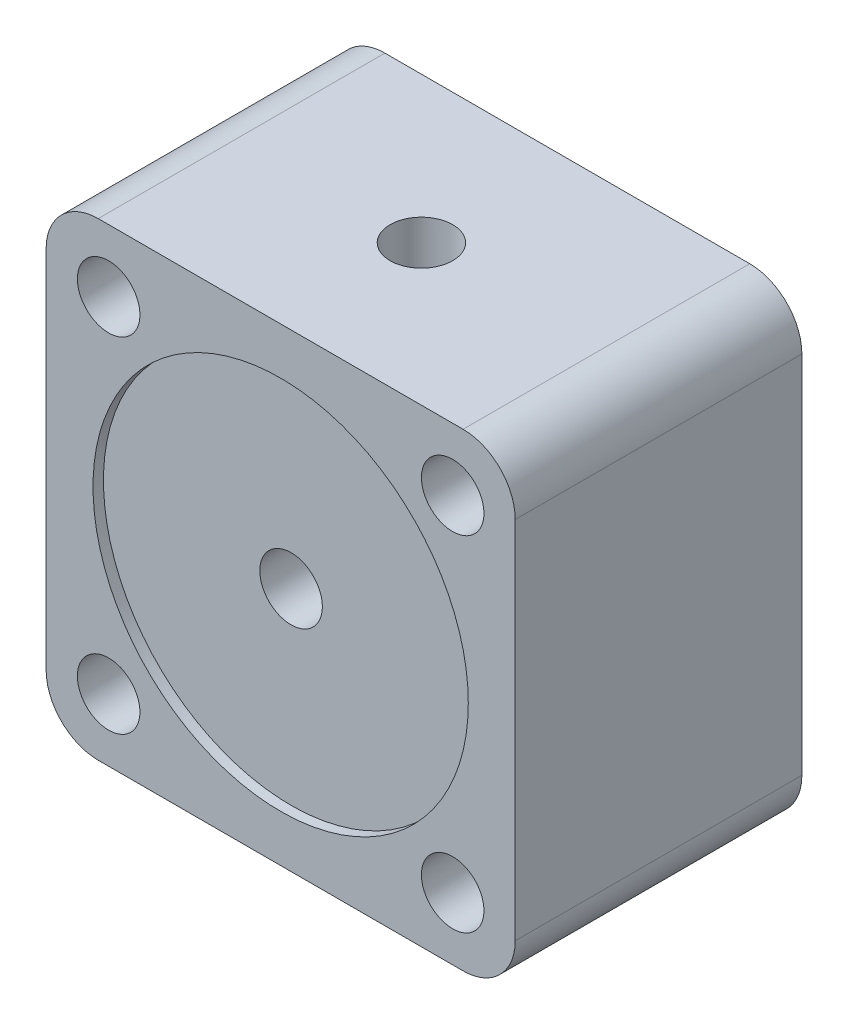
ISO-10303-21;
HEADER;
FILE_DESCRIPTION(('STEP AP214'),'2;1');
FILE_NAME('part.step','',(''),(''),'','','');
FILE_SCHEMA(('AUTOMOTIVE_DESIGN { 1 0 10303 214 1 1 1 1 }'));
ENDSEC;
DATA;
#1=APPLICATION_CONTEXT('core data for automotive mechanical design processes');
#2=APPLICATION_PROTOCOL_DEFINITION('international standard','automotive_design',2000,#1);
#3=PRODUCT_CONTEXT('',#1,'mechanical');
#4=PRODUCT('Part','Part','',(#3));
#5=PRODUCT_RELATED_PRODUCT_CATEGORY('part','',(#4));
#6=PRODUCT_DEFINITION_FORMATION('','',#4);
#7=PRODUCT_DEFINITION_CONTEXT('part definition',#1,'design');
#8=PRODUCT_DEFINITION('design','',#6,#7);
#9=PRODUCT_DEFINITION_SHAPE('','',#8);
#10=(LENGTH_UNIT() NAMED_UNIT(*) SI_UNIT(.MILLI.,.METRE.));
#11=(NAMED_UNIT(*) PLANE_ANGLE_UNIT() SI_UNIT($,.RADIAN.));
#12=(NAMED_UNIT(*) SI_UNIT($,.STERADIAN.) SOLID_ANGLE_UNIT());
#13=UNCERTAINTY_MEASURE_WITH_UNIT(LENGTH_MEASURE(1.E-05),#10,'distance_accuracy_value','');
#14=(GEOMETRIC_REPRESENTATION_CONTEXT(3) GLOBAL_UNCERTAINTY_ASSIGNED_CONTEXT((#13)) GLOBAL_UNIT_ASSIGNED_CONTEXT((#10,
#11,#12)) REPRESENTATION_CONTEXT('',''));
#15=CARTESIAN_POINT('',(0.,0.,0.));
#16=DIRECTION('',(0.,0.,1.));
#17=DIRECTION('',(1.,0.,0.));
#18=AXIS2_PLACEMENT_3D('',#15,#16,#17);
#19=CARTESIAN_POINT('',(-22.5,25.,14.));
#20=DIRECTION('',(0.,1.,0.));
#21=DIRECTION('',(-1.,0.,0.));
#22=AXIS2_PLACEMENT_3D('',#19,#20,#21);
#23=PLANE('',#22);
#24=DIRECTION('',(0.,0.,1.));
#25=VECTOR('',#24,1.);
#26=CARTESIAN_POINT('',(-24.1583123951777,25.,10.5));
#27=LINE('',#26,#25);
#28=CARTESIAN_POINT('',(-24.1583123951777,25.,11.5));
#29=VERTEX_POINT('',#28);
#30=CARTESIAN_POINT('',(-24.1583123951777,25.,16.5));
#31=VERTEX_POINT('',#30);
#32=EDGE_CURVE('E11',#29,#31,#27,.T.);
#33=ORIENTED_EDGE('',*,*,#32,.F.);
#34=CARTESIAN_POINT('',(-22.5,25.,14.));
#35=DIRECTION('',(0.,1.,0.));
#36=DIRECTION('',(-1.,0.,0.));
#37=AXIS2_PLACEMENT_3D('',#34,#35,#36);
#38=CIRCLE('',#37,3.);
#39=EDGE_CURVE('E189',#29,#31,#38,.T.);
#40=ORIENTED_EDGE('',*,*,#39,.T.);
#41=EDGE_LOOP('',(#33,#40));
#42=FACE_BOUND('',#41,.T.);
#43=ADVANCED_FACE('F32',(#42),#23,.T.);
#44=CARTESIAN_POINT('',(-40.,40.,27.5));
#45=DIRECTION('',(0.,0.,1.));
#46=DIRECTION('',(1.,0.,0.));
#47=AXIS2_PLACEMENT_3D('',#44,#45,#46);
#48=PLANE('',#47);
#49=CARTESIAN_POINT('',(-22.5,22.5,27.5));
#50=DIRECTION('',(0.,0.,1.));
#51=DIRECTION('',(1.,0.,0.));
#52=AXIS2_PLACEMENT_3D('',#49,#50,#51);
#53=CIRCLE('',#52,18.);
#54=CARTESIAN_POINT('',(-4.50000000000001,22.5,27.5));
#55=VERTEX_POINT('',#54);
#56=EDGE_CURVE('E193',#55,#55,#53,.T.);
#57=ORIENTED_EDGE('',*,*,#56,.F.);
#58=EDGE_LOOP('',(#57));
#59=FACE_BOUND('',#58,.T.);
#60=CARTESIAN_POINT('',(-39.,5.99999999999998,27.5));
#61=DIRECTION('',(0.,0.,1.));
#62=DIRECTION('',(-1.,0.,0.));
#63=AXIS2_PLACEMENT_3D('',#60,#61,#62);
#64=CIRCLE('',#63,3.);
#65=CARTESIAN_POINT('',(-42.,5.99999999999998,27.5));
#66=VERTEX_POINT('',#65);
#67=EDGE_CURVE('E211',#66,#66,#64,.T.);
#68=ORIENTED_EDGE('',*,*,#67,.F.);
#69=EDGE_LOOP('',(#68));
#70=FACE_BOUND('',#69,.T.);
#71=CARTESIAN_POINT('',(-6.00000000000001,39.,27.5));
#72=DIRECTION('',(0.,0.,1.));
#73=DIRECTION('',(1.,0.,0.));
#74=AXIS2_PLACEMENT_3D('',#71,#72,#73);
#75=CIRCLE('',#74,3.);
#76=CARTESIAN_POINT('',(-3.,39.,27.5));
#77=VERTEX_POINT('',#76);
#78=EDGE_CURVE('E145',#77,#77,#75,.T.);
#79=ORIENTED_EDGE('',*,*,#78,.F.);
#80=EDGE_LOOP('',(#79));
#81=FACE_BOUND('',#80,.T.);
#82=CARTESIAN_POINT('',(-40.,40.,27.5));
#83=DIRECTION('',(0.,0.,1.));
#84=DIRECTION('',(1.,0.,0.));
#85=AXIS2_PLACEMENT_3D('',#82,#83,#84);
#86=CIRCLE('',#85,5.);
#87=CARTESIAN_POINT('',(-40.,45.,27.5));
#88=VERTEX_POINT('',#87);
#89=CARTESIAN_POINT('',(-45.,40.,27.5));
#90=VERTEX_POINT('',#89);
#91=EDGE_CURVE('E157',#88,#90,#86,.T.);
#92=ORIENTED_EDGE('',*,*,#91,.T.);
#93=DIRECTION('',(0.,-1.,0.));
#94=VECTOR('',#93,1.);
#95=CARTESIAN_POINT('',(-45.,40.,27.5));
#96=LINE('',#95,#94);
#97=CARTESIAN_POINT('',(-45.,5.00000000000003,27.5));
#98=VERTEX_POINT('',#97);
#99=EDGE_CURVE('E97',#90,#98,#96,.T.);
#100=ORIENTED_EDGE('',*,*,#99,.T.);
#101=CARTESIAN_POINT('',(-40.,4.99999999999999,27.5));
#102=DIRECTION('',(0.,0.,1.));
#103=DIRECTION('',(1.,0.,0.));
#104=AXIS2_PLACEMENT_3D('',#101,#102,#103);
#105=CIRCLE('',#104,5.);
#106=CARTESIAN_POINT('',(-40.,0.,27.5));
#107=VERTEX_POINT('',#106);
#108=EDGE_CURVE('E229',#98,#107,#105,.T.);
#109=ORIENTED_EDGE('',*,*,#108,.T.);
#110=DIRECTION('',(1.,0.,0.));
#111=VECTOR('',#110,1.);
#112=CARTESIAN_POINT('',(-40.,0.,27.5));
#113=LINE('',#112,#111);
#114=CARTESIAN_POINT('',(-5.00000000000004,0.,27.5));
#115=VERTEX_POINT('',#114);
#116=EDGE_CURVE('E231',#107,#115,#113,.T.);
#117=ORIENTED_EDGE('',*,*,#116,.T.);
#118=CARTESIAN_POINT('',(-5.,5.,27.5));
#119=DIRECTION('',(0.,0.,1.));
#120=DIRECTION('',(1.,0.,0.));
#121=AXIS2_PLACEMENT_3D('',#118,#119,#120);
#122=CIRCLE('',#121,5.);
#123=CARTESIAN_POINT('',(0.,5.00000000000004,27.5));
#124=VERTEX_POINT('',#123);
#125=EDGE_CURVE('E120',#115,#124,#122,.T.);
#126=ORIENTED_EDGE('',*,*,#125,.T.);
#127=DIRECTION('',(0.,1.,0.));
#128=VECTOR('',#127,1.);
#129=CARTESIAN_POINT('',(0.,40.,27.5));
#130=LINE('',#129,#128);
#131=CARTESIAN_POINT('',(0.,40.,27.5));
#132=VERTEX_POINT('',#131);
#133=EDGE_CURVE('E112',#124,#132,#130,.T.);
#134=ORIENTED_EDGE('',*,*,#133,.T.);
#135=CARTESIAN_POINT('',(-5.,40.,27.5));
#136=DIRECTION('',(0.,0.,1.));
#137=DIRECTION('',(1.,0.,0.));
#138=AXIS2_PLACEMENT_3D('',#135,#136,#137);
#139=CIRCLE('',#138,5.);
#140=CARTESIAN_POINT('',(-5.00000000000004,45.,27.5));
#141=VERTEX_POINT('',#140);
#142=EDGE_CURVE('E117',#132,#141,#139,.T.);
#143=ORIENTED_EDGE('',*,*,#142,.T.);
#144=DIRECTION('',(-1.,0.,0.));
#145=VECTOR('',#144,1.);
#146=CARTESIAN_POINT('',(-5.00000000000004,45.,27.5));
#147=LINE('',#146,#145);
#148=EDGE_CURVE('E55',#141,#88,#147,.T.);
#149=ORIENTED_EDGE('',*,*,#148,.T.);
#150=EDGE_LOOP('',(#92,#100,#109,#117,#126,#134,#143,#149));
#151=FACE_BOUND('',#150,.T.);
#152=CARTESIAN_POINT('',(-6.00000000000001,5.99999999999998,27.5));
#153=DIRECTION('',(0.,0.,1.));
#154=DIRECTION('',(1.,0.,0.));
#155=AXIS2_PLACEMENT_3D('',#152,#153,#154);
#156=CIRCLE('',#155,3.);
#157=CARTESIAN_POINT('',(-3.00000000000001,5.99999999999998,27.5));
#158=VERTEX_POINT('',#157);
#159=EDGE_CURVE('E217',#158,#158,#156,.T.);
#160=ORIENTED_EDGE('',*,*,#159,.F.);
#161=EDGE_LOOP('',(#160));
#162=FACE_BOUND('',#161,.T.);
#163=CARTESIAN_POINT('',(-39.,39.,27.5));
#164=DIRECTION('',(0.,0.,1.));
#165=DIRECTION('',(-1.,0.,0.));
#166=AXIS2_PLACEMENT_3D('',#163,#164,#165);
#167=CIRCLE('',#166,3.);
#168=CARTESIAN_POINT('',(-42.,39.,27.5));
#169=VERTEX_POINT('',#168);
#170=EDGE_CURVE('E205',#169,#169,#167,.T.);
#171=ORIENTED_EDGE('',*,*,#170,.F.);
#172=EDGE_LOOP('',(#171));
#173=FACE_BOUND('',#172,.T.);
#174=ADVANCED_FACE('F114',(#59,#70,#81,#151,#162,#173),#48,.T.);
#175=CARTESIAN_POINT('',(-40.,40.,0.));
#176=DIRECTION('',(0.,0.,1.));
#177=DIRECTION('',(1.,0.,0.));
#178=AXIS2_PLACEMENT_3D('',#175,#176,#177);
#179=PLANE('',#178);
#180=CARTESIAN_POINT('',(-40.,40.,0.));
#181=DIRECTION('',(0.,0.,1.));
#182=DIRECTION('',(1.,0.,0.));
#183=AXIS2_PLACEMENT_3D('',#180,#181,#182);
#184=CIRCLE('',#183,5.);
#185=CARTESIAN_POINT('',(-40.,45.,0.));
#186=VERTEX_POINT('',#185);
#187=CARTESIAN_POINT('',(-45.,40.,0.));
#188=VERTEX_POINT('',#187);
#189=EDGE_CURVE('E141',#186,#188,#184,.T.);
#190=ORIENTED_EDGE('',*,*,#189,.F.);
#191=DIRECTION('',(-1.,0.,0.));
#192=VECTOR('',#191,1.);
#193=CARTESIAN_POINT('',(-5.00000000000004,45.,0.));
#194=LINE('',#193,#192);
#195=CARTESIAN_POINT('',(-5.00000000000004,45.,0.));
#196=VERTEX_POINT('',#195);
#197=EDGE_CURVE('E88',#196,#186,#194,.T.);
#198=ORIENTED_EDGE('',*,*,#197,.F.);
#199=CARTESIAN_POINT('',(-5.,40.,0.));
#200=DIRECTION('',(0.,0.,1.));
#201=DIRECTION('',(1.,0.,0.));
#202=AXIS2_PLACEMENT_3D('',#199,#200,#201);
#203=CIRCLE('',#202,5.);
#204=CARTESIAN_POINT('',(0.,40.,0.));
#205=VERTEX_POINT('',#204);
#206=EDGE_CURVE('E154',#205,#196,#203,.T.);
#207=ORIENTED_EDGE('',*,*,#206,.F.);
#208=DIRECTION('',(0.,1.,0.));
#209=VECTOR('',#208,1.);
#210=CARTESIAN_POINT('',(0.,40.,0.));
#211=LINE('',#210,#209);
#212=CARTESIAN_POINT('',(0.,5.00000000000004,0.));
#213=VERTEX_POINT('',#212);
#214=EDGE_CURVE('E129',#213,#205,#211,.T.);
#215=ORIENTED_EDGE('',*,*,#214,.F.);
#216=CARTESIAN_POINT('',(-5.,5.,0.));
#217=DIRECTION('',(0.,0.,1.));
#218=DIRECTION('',(1.,0.,0.));
#219=AXIS2_PLACEMENT_3D('',#216,#217,#218);
#220=CIRCLE('',#219,5.);
#221=CARTESIAN_POINT('',(-5.00000000000004,0.,0.));
#222=VERTEX_POINT('',#221);
#223=EDGE_CURVE('E151',#222,#213,#220,.T.);
#224=ORIENTED_EDGE('',*,*,#223,.F.);
#225=DIRECTION('',(1.,0.,0.));
#226=VECTOR('',#225,1.);
#227=CARTESIAN_POINT('',(-40.,0.,0.));
#228=LINE('',#227,#226);
#229=CARTESIAN_POINT('',(-40.,0.,0.));
#230=VERTEX_POINT('',#229);
#231=EDGE_CURVE('E149',#230,#222,#228,.T.);
#232=ORIENTED_EDGE('',*,*,#231,.F.);
#233=CARTESIAN_POINT('',(-40.,4.99999999999999,0.));
#234=DIRECTION('',(0.,0.,1.));
#235=DIRECTION('',(1.,0.,0.));
#236=AXIS2_PLACEMENT_3D('',#233,#234,#235);
#237=CIRCLE('',#236,5.);
#238=CARTESIAN_POINT('',(-45.,5.00000000000003,0.));
#239=VERTEX_POINT('',#238);
#240=EDGE_CURVE('E147',#239,#230,#237,.T.);
#241=ORIENTED_EDGE('',*,*,#240,.F.);
#242=DIRECTION('',(0.,-1.,0.));
#243=VECTOR('',#242,1.);
#244=CARTESIAN_POINT('',(-45.,40.,0.));
#245=LINE('',#244,#243);
#246=EDGE_CURVE('E144',#188,#239,#245,.T.);
#247=ORIENTED_EDGE('',*,*,#246,.F.);
#248=EDGE_LOOP('',(#190,#198,#207,#215,#224,#232,#241,#247));
#249=FACE_BOUND('',#248,.T.);
#250=CARTESIAN_POINT('',(-6.00000000000001,39.,0.));
#251=DIRECTION('',(0.,0.,1.));
#252=DIRECTION('',(1.,0.,0.));
#253=AXIS2_PLACEMENT_3D('',#250,#251,#252);
#254=CIRCLE('',#253,3.);
#255=CARTESIAN_POINT('',(-3.,39.,0.));
#256=VERTEX_POINT('',#255);
#257=EDGE_CURVE('E220',#256,#256,#254,.T.);
#258=ORIENTED_EDGE('',*,*,#257,.T.);
#259=EDGE_LOOP('',(#258));
#260=FACE_BOUND('',#259,.T.);
#261=CARTESIAN_POINT('',(-6.00000000000001,5.99999999999998,0.));
#262=DIRECTION('',(0.,0.,1.));
#263=DIRECTION('',(1.,0.,0.));
#264=AXIS2_PLACEMENT_3D('',#261,#262,#263);
#265=CIRCLE('',#264,3.);
#266=CARTESIAN_POINT('',(-3.00000000000001,5.99999999999998,0.));
#267=VERTEX_POINT('',#266);
#268=EDGE_CURVE('E214',#267,#267,#265,.T.);
#269=ORIENTED_EDGE('',*,*,#268,.T.);
#270=EDGE_LOOP('',(#269));
#271=FACE_BOUND('',#270,.T.);
#272=CARTESIAN_POINT('',(-39.,5.99999999999998,0.));
#273=DIRECTION('',(0.,0.,1.));
#274=DIRECTION('',(-1.,0.,0.));
#275=AXIS2_PLACEMENT_3D('',#272,#273,#274);
#276=CIRCLE('',#275,3.);
#277=CARTESIAN_POINT('',(-42.,5.99999999999998,0.));
#278=VERTEX_POINT('',#277);
#279=EDGE_CURVE('E208',#278,#278,#276,.T.);
#280=ORIENTED_EDGE('',*,*,#279,.T.);
#281=EDGE_LOOP('',(#280));
#282=FACE_BOUND('',#281,.T.);
#283=CARTESIAN_POINT('',(-39.,39.,0.));
#284=DIRECTION('',(0.,0.,1.));
#285=DIRECTION('',(-1.,0.,0.));
#286=AXIS2_PLACEMENT_3D('',#283,#284,#285);
#287=CIRCLE('',#286,3.);
#288=CARTESIAN_POINT('',(-42.,39.,0.));
#289=VERTEX_POINT('',#288);
#290=EDGE_CURVE('E203',#289,#289,#287,.T.);
#291=ORIENTED_EDGE('',*,*,#290,.T.);
#292=EDGE_LOOP('',(#291));
#293=FACE_BOUND('',#292,.T.);
#294=ADVANCED_FACE('F244',(#249,#260,#271,#282,#293),#179,.F.);
#295=CARTESIAN_POINT('',(-40.,40.,27.5));
#296=DIRECTION('',(0.,0.,-1.));
#297=DIRECTION('',(-1.,0.,0.));
#298=AXIS2_PLACEMENT_3D('',#295,#296,#297);
#299=CYLINDRICAL_SURFACE('',#298,5.);
#300=ORIENTED_EDGE('',*,*,#189,.T.);
#301=DIRECTION('',(0.,0.,-1.));
#302=VECTOR('',#301,1.);
#303=CARTESIAN_POINT('',(-45.,40.,27.5));
#304=LINE('',#303,#302);
#305=EDGE_CURVE('E170',#90,#188,#304,.T.);
#306=ORIENTED_EDGE('',*,*,#305,.F.);
#307=ORIENTED_EDGE('',*,*,#91,.F.);
#308=DIRECTION('',(0.,0.,-1.));
#309=VECTOR('',#308,1.);
#310=CARTESIAN_POINT('',(-40.,45.,27.5));
#311=LINE('',#310,#309);
#312=EDGE_CURVE('E137',#88,#186,#311,.T.);
#313=ORIENTED_EDGE('',*,*,#312,.T.);
#314=EDGE_LOOP('',(#300,#306,#307,#313));
#315=FACE_BOUND('',#314,.T.);
#316=ADVANCED_FACE('F34',(#315),#299,.T.);
#317=CARTESIAN_POINT('',(-45.,40.,27.5));
#318=DIRECTION('',(1.,0.,0.));
#319=DIRECTION('',(0.,1.,0.));
#320=AXIS2_PLACEMENT_3D('',#317,#318,#319);
#321=PLANE('',#320);
#322=ORIENTED_EDGE('',*,*,#246,.T.);
#323=DIRECTION('',(0.,0.,-1.));
#324=VECTOR('',#323,1.);
#325=CARTESIAN_POINT('',(-45.,5.00000000000003,27.5));
#326=LINE('',#325,#324);
#327=EDGE_CURVE('E167',#98,#239,#326,.T.);
#328=ORIENTED_EDGE('',*,*,#327,.F.);
#329=ORIENTED_EDGE('',*,*,#99,.F.);
#330=ORIENTED_EDGE('',*,*,#305,.T.);
#331=EDGE_LOOP('',(#322,#328,#329,#330));
#332=FACE_BOUND('',#331,.T.);
#333=ADVANCED_FACE('F250',(#332),#321,.F.);
#334=CARTESIAN_POINT('',(-40.,4.99999999999999,27.5));
#335=DIRECTION('',(0.,0.,-1.));
#336=DIRECTION('',(-1.,0.,0.));
#337=AXIS2_PLACEMENT_3D('',#334,#335,#336);
#338=CYLINDRICAL_SURFACE('',#337,5.);
#339=ORIENTED_EDGE('',*,*,#240,.T.);
#340=DIRECTION('',(0.,0.,-1.));
#341=VECTOR('',#340,1.);
#342=CARTESIAN_POINT('',(-40.,0.,27.5));
#343=LINE('',#342,#341);
#344=EDGE_CURVE('E164',#107,#230,#343,.T.);
#345=ORIENTED_EDGE('',*,*,#344,.F.);
#346=ORIENTED_EDGE('',*,*,#108,.F.);
#347=ORIENTED_EDGE('',*,*,#327,.T.);
#348=EDGE_LOOP('',(#339,#345,#346,#347));
#349=FACE_BOUND('',#348,.T.);
#350=ADVANCED_FACE('F253',(#349),#338,.T.);
#351=CARTESIAN_POINT('',(-40.,0.,27.5));
#352=DIRECTION('',(0.,1.,0.));
#353=DIRECTION('',(-1.,0.,0.));
#354=AXIS2_PLACEMENT_3D('',#351,#352,#353);
#355=PLANE('',#354);
#356=ORIENTED_EDGE('',*,*,#231,.T.);
#357=DIRECTION('',(0.,0.,-1.));
#358=VECTOR('',#357,1.);
#359=CARTESIAN_POINT('',(-5.00000000000004,0.,27.5));
#360=LINE('',#359,#358);
#361=EDGE_CURVE('E161',#115,#222,#360,.T.);
#362=ORIENTED_EDGE('',*,*,#361,.F.);
#363=ORIENTED_EDGE('',*,*,#116,.F.);
#364=ORIENTED_EDGE('',*,*,#344,.T.);
#365=EDGE_LOOP('',(#356,#362,#363,#364));
#366=FACE_BOUND('',#365,.T.);
#367=ADVANCED_FACE('F237',(#366),#355,.F.);
#368=CARTESIAN_POINT('',(-5.,5.,27.5));
#369=DIRECTION('',(0.,0.,-1.));
#370=DIRECTION('',(-1.,0.,0.));
#371=AXIS2_PLACEMENT_3D('',#368,#369,#370);
#372=CYLINDRICAL_SURFACE('',#371,5.);
#373=ORIENTED_EDGE('',*,*,#223,.T.);
#374=DIRECTION('',(0.,0.,-1.));
#375=VECTOR('',#374,1.);
#376=CARTESIAN_POINT('',(0.,5.00000000000004,27.5));
#377=LINE('',#376,#375);
#378=EDGE_CURVE('E132',#124,#213,#377,.T.);
#379=ORIENTED_EDGE('',*,*,#378,.F.);
#380=ORIENTED_EDGE('',*,*,#125,.F.);
#381=ORIENTED_EDGE('',*,*,#361,.T.);
#382=EDGE_LOOP('',(#373,#379,#380,#381));
#383=FACE_BOUND('',#382,.T.);
#384=ADVANCED_FACE('F241',(#383),#372,.T.);
#385=CARTESIAN_POINT('',(0.,40.,27.5));
#386=DIRECTION('',(-1.,0.,0.));
#387=DIRECTION('',(0.,0.,1.));
#388=AXIS2_PLACEMENT_3D('',#385,#386,#387);
#389=PLANE('',#388);
#390=ORIENTED_EDGE('',*,*,#214,.T.);
#391=DIRECTION('',(0.,0.,-1.));
#392=VECTOR('',#391,1.);
#393=CARTESIAN_POINT('',(0.,40.,27.5));
#394=LINE('',#393,#392);
#395=EDGE_CURVE('E126',#132,#205,#394,.T.);
#396=ORIENTED_EDGE('',*,*,#395,.F.);
#397=ORIENTED_EDGE('',*,*,#133,.F.);
#398=ORIENTED_EDGE('',*,*,#378,.T.);
#399=EDGE_LOOP('',(#390,#396,#397,#398));
#400=FACE_BOUND('',#399,.T.);
#401=ADVANCED_FACE('F127',(#400),#389,.F.);
#402=CARTESIAN_POINT('',(-5.,40.,27.5));
#403=DIRECTION('',(0.,0.,-1.));
#404=DIRECTION('',(-1.,0.,0.));
#405=AXIS2_PLACEMENT_3D('',#402,#403,#404);
#406=CYLINDRICAL_SURFACE('',#405,5.);
#407=ORIENTED_EDGE('',*,*,#206,.T.);
#408=DIRECTION('',(0.,0.,-1.));
#409=VECTOR('',#408,1.);
#410=CARTESIAN_POINT('',(-5.00000000000004,45.,27.5));
#411=LINE('',#410,#409);
#412=EDGE_CURVE('E133',#141,#196,#411,.T.);
#413=ORIENTED_EDGE('',*,*,#412,.F.);
#414=ORIENTED_EDGE('',*,*,#142,.F.);
#415=ORIENTED_EDGE('',*,*,#395,.T.);
#416=EDGE_LOOP('',(#407,#413,#414,#415));
#417=FACE_BOUND('',#416,.T.);
#418=ADVANCED_FACE('F135',(#417),#406,.T.);
#419=CARTESIAN_POINT('',(-5.00000000000004,45.,27.5));
#420=DIRECTION('',(0.,-1.,0.));
#421=DIRECTION('',(1.,0.,0.));
#422=AXIS2_PLACEMENT_3D('',#419,#420,#421);
#423=PLANE('',#422);
#424=CARTESIAN_POINT('',(-22.5,45.,14.));
#425=DIRECTION('',(0.,1.,0.));
#426=DIRECTION('',(-1.,0.,0.));
#427=AXIS2_PLACEMENT_3D('',#424,#425,#426);
#428=CIRCLE('',#427,3.);
#429=CARTESIAN_POINT('',(-25.5,45.,14.));
#430=VERTEX_POINT('',#429);
#431=EDGE_CURVE('E190',#430,#430,#428,.T.);
#432=ORIENTED_EDGE('',*,*,#431,.F.);
#433=EDGE_LOOP('',(#432));
#434=FACE_BOUND('',#433,.T.);
#435=ORIENTED_EDGE('',*,*,#197,.T.);
#436=ORIENTED_EDGE('',*,*,#312,.F.);
#437=ORIENTED_EDGE('',*,*,#148,.F.);
#438=ORIENTED_EDGE('',*,*,#412,.T.);
#439=EDGE_LOOP('',(#435,#436,#437,#438));
#440=FACE_BOUND('',#439,.T.);
#441=ADVANCED_FACE('F246',(#434,#440),#423,.F.);
#442=CARTESIAN_POINT('',(-6.00000000000001,39.,27.5));
#443=DIRECTION('',(0.,0.,-1.));
#444=DIRECTION('',(-1.,0.,0.));
#445=AXIS2_PLACEMENT_3D('',#442,#443,#444);
#446=CYLINDRICAL_SURFACE('',#445,3.);
#447=ORIENTED_EDGE('',*,*,#78,.T.);
#448=EDGE_LOOP('',(#447));
#449=FACE_BOUND('',#448,.T.);
#450=ORIENTED_EDGE('',*,*,#257,.F.);
#451=EDGE_LOOP('',(#450));
#452=FACE_BOUND('',#451,.T.);
#453=ADVANCED_FACE('F299',(#449,#452),#446,.F.);
#454=CARTESIAN_POINT('',(-6.00000000000001,5.99999999999998,27.5));
#455=DIRECTION('',(0.,0.,-1.));
#456=DIRECTION('',(-1.,0.,0.));
#457=AXIS2_PLACEMENT_3D('',#454,#455,#456);
#458=CYLINDRICAL_SURFACE('',#457,3.);
#459=ORIENTED_EDGE('',*,*,#159,.T.);
#460=EDGE_LOOP('',(#459));
#461=FACE_BOUND('',#460,.T.);
#462=ORIENTED_EDGE('',*,*,#268,.F.);
#463=EDGE_LOOP('',(#462));
#464=FACE_BOUND('',#463,.T.);
#465=ADVANCED_FACE('F295',(#461,#464),#458,.F.);
#466=CARTESIAN_POINT('',(-39.,5.99999999999998,27.5));
#467=DIRECTION('',(0.,0.,-1.));
#468=DIRECTION('',(-1.,0.,0.));
#469=AXIS2_PLACEMENT_3D('',#466,#467,#468);
#470=CYLINDRICAL_SURFACE('',#469,3.);
#471=ORIENTED_EDGE('',*,*,#67,.T.);
#472=EDGE_LOOP('',(#471));
#473=FACE_BOUND('',#472,.T.);
#474=ORIENTED_EDGE('',*,*,#279,.F.);
#475=EDGE_LOOP('',(#474));
#476=FACE_BOUND('',#475,.T.);
#477=ADVANCED_FACE('F291',(#473,#476),#470,.F.);
#478=CARTESIAN_POINT('',(-39.,39.,27.5));
#479=DIRECTION('',(0.,0.,-1.));
#480=DIRECTION('',(-1.,0.,0.));
#481=AXIS2_PLACEMENT_3D('',#478,#479,#480);
#482=CYLINDRICAL_SURFACE('',#481,3.);
#483=ORIENTED_EDGE('',*,*,#170,.T.);
#484=EDGE_LOOP('',(#483));
#485=FACE_BOUND('',#484,.T.);
#486=ORIENTED_EDGE('',*,*,#290,.F.);
#487=EDGE_LOOP('',(#486));
#488=FACE_BOUND('',#487,.T.);
#489=ADVANCED_FACE('F287',(#485,#488),#482,.F.);
#490=CARTESIAN_POINT('',(-22.5,22.5,26.5));
#491=DIRECTION('',(0.,0.,1.));
#492=DIRECTION('',(1.,0.,0.));
#493=AXIS2_PLACEMENT_3D('',#490,#491,#492);
#494=CYLINDRICAL_SURFACE('',#493,18.);
#495=CARTESIAN_POINT('',(-22.5,22.5,26.5));
#496=DIRECTION('',(0.,0.,1.));
#497=DIRECTION('',(1.,0.,0.));
#498=AXIS2_PLACEMENT_3D('',#495,#496,#497);
#499=CIRCLE('',#498,18.);
#500=CARTESIAN_POINT('',(-4.50000000000001,22.5,26.5));
#501=VERTEX_POINT('',#500);
#502=EDGE_CURVE('E196',#501,#501,#499,.T.);
#503=ORIENTED_EDGE('',*,*,#502,.F.);
#504=EDGE_LOOP('',(#503));
#505=FACE_BOUND('',#504,.T.);
#506=ORIENTED_EDGE('',*,*,#56,.T.);
#507=EDGE_LOOP('',(#506));
#508=FACE_BOUND('',#507,.T.);
#509=ADVANCED_FACE('F281',(#505,#508),#494,.F.);
#510=CARTESIAN_POINT('',(-22.5,22.5,26.5));
#511=DIRECTION('',(0.,0.,1.));
#512=DIRECTION('',(1.,0.,0.));
#513=AXIS2_PLACEMENT_3D('',#510,#511,#512);
#514=PLANE('',#513);
#515=CARTESIAN_POINT('',(-22.5,22.5,26.5));
#516=DIRECTION('',(0.,0.,1.));
#517=DIRECTION('',(1.,0.,0.));
#518=AXIS2_PLACEMENT_3D('',#515,#516,#517);
#519=CIRCLE('',#518,3.);
#520=CARTESIAN_POINT('',(-19.5,22.5,26.5));
#521=VERTEX_POINT('',#520);
#522=EDGE_CURVE('E387',#521,#521,#519,.T.);
#523=ORIENTED_EDGE('',*,*,#522,.F.);
#524=EDGE_LOOP('',(#523));
#525=FACE_BOUND('',#524,.T.);
#526=ORIENTED_EDGE('',*,*,#502,.T.);
#527=EDGE_LOOP('',(#526));
#528=FACE_BOUND('',#527,.T.);
#529=ADVANCED_FACE('F277',(#525,#528),#514,.T.);
#530=CARTESIAN_POINT('',(-22.5,25.,14.));
#531=DIRECTION('',(0.,1.,0.));
#532=DIRECTION('',(-1.,0.,0.));
#533=AXIS2_PLACEMENT_3D('',#530,#531,#532);
#534=CYLINDRICAL_SURFACE('',#533,3.);
#535=ORIENTED_EDGE('',*,*,#39,.F.);
#536=CARTESIAN_POINT('',(-22.5,22.5,14.));
#537=DIRECTION('',(0.,0.707106781186547,0.707106781186547));
#538=DIRECTION('',(0.,0.707106781186547,-0.707106781186547));
#539=AXIS2_PLACEMENT_3D('',#536,#537,#538);
#540=ELLIPSE('',#539,4.24264068711929,3.);
#541=CARTESIAN_POINT('',(-20.8416876048223,25.,11.5));
#542=VERTEX_POINT('',#541);
#543=EDGE_CURVE('E176',#29,#542,#540,.F.);
#544=ORIENTED_EDGE('',*,*,#543,.T.);
#545=CARTESIAN_POINT('',(-20.8416876048223,25.,16.5));
#546=VERTEX_POINT('',#545);
#547=EDGE_CURVE('E187',#546,#542,#38,.T.);
#548=ORIENTED_EDGE('',*,*,#547,.F.);
#549=CARTESIAN_POINT('',(-22.5,22.5,14.));
#550=DIRECTION('',(0.,0.707106781186547,-0.707106781186547));
#551=DIRECTION('',(0.,0.707106781186547,0.707106781186547));
#552=AXIS2_PLACEMENT_3D('',#549,#550,#551);
#553=ELLIPSE('',#552,4.24264068711929,3.);
#554=EDGE_CURVE('E46',#546,#31,#553,.F.);
#555=ORIENTED_EDGE('',*,*,#554,.T.);
#556=EDGE_LOOP('',(#535,#544,#548,#555));
#557=FACE_BOUND('',#556,.T.);
#558=ORIENTED_EDGE('',*,*,#431,.T.);
#559=EDGE_LOOP('',(#558));
#560=FACE_BOUND('',#559,.T.);
#561=ADVANCED_FACE('F185',(#557,#560),#534,.F.);
#562=DIRECTION('',(0.,0.,1.));
#563=VECTOR('',#562,1.);
#564=CARTESIAN_POINT('',(-20.8416876048223,25.,10.5));
#565=LINE('',#564,#563);
#566=EDGE_CURVE('E40',#546,#542,#565,.F.);
#567=ORIENTED_EDGE('',*,*,#566,.F.);
#568=ORIENTED_EDGE('',*,*,#547,.T.);
#569=EDGE_LOOP('',(#567,#568));
#570=FACE_BOUND('',#569,.T.);
#571=ADVANCED_FACE('F192',(#570),#23,.T.);
#572=CARTESIAN_POINT('',(-22.5,22.5,10.5));
#573=DIRECTION('',(0.,0.,1.));
#574=DIRECTION('',(1.,0.,0.));
#575=AXIS2_PLACEMENT_3D('',#572,#573,#574);
#576=CYLINDRICAL_SURFACE('',#575,3.);
#577=ORIENTED_EDGE('',*,*,#32,.T.);
#578=ORIENTED_EDGE('',*,*,#554,.F.);
#579=ORIENTED_EDGE('',*,*,#566,.T.);
#580=ORIENTED_EDGE('',*,*,#543,.F.);
#581=EDGE_LOOP('',(#577,#578,#579,#580));
#582=FACE_BOUND('',#581,.T.);
#583=CARTESIAN_POINT('',(-22.5,22.5,10.5));
#584=DIRECTION('',(0.,0.,1.));
#585=DIRECTION('',(1.,0.,0.));
#586=AXIS2_PLACEMENT_3D('',#583,#584,#585);
#587=CIRCLE('',#586,3.);
#588=CARTESIAN_POINT('',(-19.5,22.5,10.5));
#589=VERTEX_POINT('',#588);
#590=EDGE_CURVE('E386',#589,#589,#587,.T.);
#591=ORIENTED_EDGE('',*,*,#590,.F.);
#592=EDGE_LOOP('',(#591));
#593=FACE_BOUND('',#592,.T.);
#594=ORIENTED_EDGE('',*,*,#522,.T.);
#595=EDGE_LOOP('',(#594));
#596=FACE_BOUND('',#595,.T.);
#597=ADVANCED_FACE('F174',(#582,#593,#596),#576,.F.);
#598=CARTESIAN_POINT('',(-22.5,22.5,10.5));
#599=DIRECTION('',(0.,0.,1.));
#600=DIRECTION('',(1.,0.,0.));
#601=AXIS2_PLACEMENT_3D('',#598,#599,#600);
#602=PLANE('',#601);
#603=ORIENTED_EDGE('',*,*,#590,.T.);
#604=EDGE_LOOP('',(#603));
#605=FACE_BOUND('',#604,.T.);
#606=ADVANCED_FACE('F276',(#605),#602,.T.);
#607=CLOSED_SHELL('',(#43,#174,#294,#316,#333,#350,#367,#384,#401,#418,#441,#453,#465,#477,#489,
#509,#529,#561,#571,#597,#606));
#608=MANIFOLD_SOLID_BREP('B2',#607);
#609=ADVANCED_BREP_SHAPE_REPRESENTATION('',(#18,#608),#14);
#610=SHAPE_DEFINITION_REPRESENTATION(#9,#609);
ENDSEC;
END-ISO-10303-21;
